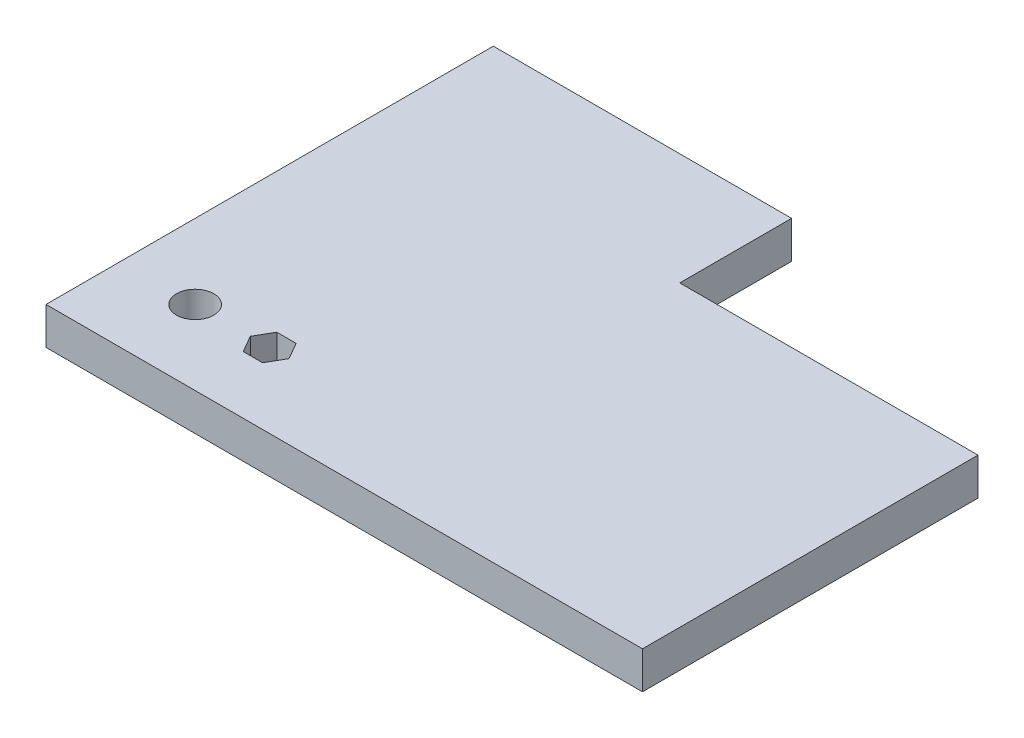
ISO-10303-21;
HEADER;
FILE_DESCRIPTION(('STEP AP214'),'2;1');
FILE_NAME('part.step','',(''),(''),'','','');
FILE_SCHEMA(('AUTOMOTIVE_DESIGN { 1 0 10303 214 1 1 1 1 }'));
ENDSEC;
DATA;
#1=APPLICATION_CONTEXT('core data for automotive mechanical design processes');
#2=APPLICATION_PROTOCOL_DEFINITION('international standard','automotive_design',2000,#1);
#3=PRODUCT_CONTEXT('',#1,'mechanical');
#4=PRODUCT('Part','Part','',(#3));
#5=PRODUCT_RELATED_PRODUCT_CATEGORY('part','',(#4));
#6=PRODUCT_DEFINITION_FORMATION('','',#4);
#7=PRODUCT_DEFINITION_CONTEXT('part definition',#1,'design');
#8=PRODUCT_DEFINITION('design','',#6,#7);
#9=PRODUCT_DEFINITION_SHAPE('','',#8);
#10=(LENGTH_UNIT() NAMED_UNIT(*) SI_UNIT(.MILLI.,.METRE.));
#11=(NAMED_UNIT(*) PLANE_ANGLE_UNIT() SI_UNIT($,.RADIAN.));
#12=(NAMED_UNIT(*) SI_UNIT($,.STERADIAN.) SOLID_ANGLE_UNIT());
#13=UNCERTAINTY_MEASURE_WITH_UNIT(LENGTH_MEASURE(1.E-05),#10,'distance_accuracy_value','');
#14=(GEOMETRIC_REPRESENTATION_CONTEXT(3) GLOBAL_UNCERTAINTY_ASSIGNED_CONTEXT((#13)) GLOBAL_UNIT_ASSIGNED_CONTEXT((#10,
#11,#12)) REPRESENTATION_CONTEXT('',''));
#15=CARTESIAN_POINT('',(0.,0.,0.));
#16=DIRECTION('',(0.,0.,1.));
#17=DIRECTION('',(1.,0.,0.));
#18=AXIS2_PLACEMENT_3D('',#15,#16,#17);
#19=CARTESIAN_POINT('',(800.,50.,0.));
#20=DIRECTION('',(0.,0.,-1.));
#21=DIRECTION('',(-1.,0.,0.));
#22=AXIS2_PLACEMENT_3D('',#19,#20,#21);
#23=PLANE('',#22);
#24=DIRECTION('',(1.,0.,0.));
#25=VECTOR('',#24,1.);
#26=CARTESIAN_POINT('',(800.,0.,0.));
#27=LINE('',#26,#25);
#28=CARTESIAN_POINT('',(0.,0.,0.));
#29=VERTEX_POINT('',#28);
#30=CARTESIAN_POINT('',(800.,0.,0.));
#31=VERTEX_POINT('',#30);
#32=EDGE_CURVE('E176',#29,#31,#27,.T.);
#33=ORIENTED_EDGE('',*,*,#32,.T.);
#34=DIRECTION('',(0.,-1.,0.));
#35=VECTOR('',#34,1.);
#36=CARTESIAN_POINT('',(800.,50.,0.));
#37=LINE('',#36,#35);
#38=CARTESIAN_POINT('',(800.,50.,0.));
#39=VERTEX_POINT('',#38);
#40=EDGE_CURVE('E11',#39,#31,#37,.T.);
#41=ORIENTED_EDGE('',*,*,#40,.F.);
#42=DIRECTION('',(1.,0.,0.));
#43=VECTOR('',#42,1.);
#44=CARTESIAN_POINT('',(800.,50.,0.));
#45=LINE('',#44,#43);
#46=CARTESIAN_POINT('',(0.,50.,0.));
#47=VERTEX_POINT('',#46);
#48=EDGE_CURVE('E179',#47,#39,#45,.T.);
#49=ORIENTED_EDGE('',*,*,#48,.F.);
#50=DIRECTION('',(0.,-1.,0.));
#51=VECTOR('',#50,1.);
#52=CARTESIAN_POINT('',(0.,50.,0.));
#53=LINE('',#52,#51);
#54=EDGE_CURVE('E193',#47,#29,#53,.T.);
#55=ORIENTED_EDGE('',*,*,#54,.T.);
#56=EDGE_LOOP('',(#33,#41,#49,#55));
#57=FACE_BOUND('',#56,.T.);
#58=ADVANCED_FACE('F32',(#57),#23,.F.);
#59=CARTESIAN_POINT('',(800.,50.,-450.));
#60=DIRECTION('',(-1.,0.,0.));
#61=DIRECTION('',(0.,0.,1.));
#62=AXIS2_PLACEMENT_3D('',#59,#60,#61);
#63=PLANE('',#62);
#64=DIRECTION('',(0.,0.,-1.));
#65=VECTOR('',#64,1.);
#66=CARTESIAN_POINT('',(800.,0.,-450.));
#67=LINE('',#66,#65);
#68=CARTESIAN_POINT('',(800.,0.,-450.));
#69=VERTEX_POINT('',#68);
#70=EDGE_CURVE('E196',#31,#69,#67,.T.);
#71=ORIENTED_EDGE('',*,*,#70,.T.);
#72=DIRECTION('',(0.,-1.,0.));
#73=VECTOR('',#72,1.);
#74=CARTESIAN_POINT('',(800.,50.,-450.));
#75=LINE('',#74,#73);
#76=CARTESIAN_POINT('',(800.,50.,-450.));
#77=VERTEX_POINT('',#76);
#78=EDGE_CURVE('E39',#77,#69,#75,.T.);
#79=ORIENTED_EDGE('',*,*,#78,.F.);
#80=DIRECTION('',(0.,0.,-1.));
#81=VECTOR('',#80,1.);
#82=CARTESIAN_POINT('',(800.,50.,-450.));
#83=LINE('',#82,#81);
#84=EDGE_CURVE('E182',#39,#77,#83,.T.);
#85=ORIENTED_EDGE('',*,*,#84,.F.);
#86=ORIENTED_EDGE('',*,*,#40,.T.);
#87=EDGE_LOOP('',(#71,#79,#85,#86));
#88=FACE_BOUND('',#87,.T.);
#89=ADVANCED_FACE('F242',(#88),#63,.F.);
#90=CARTESIAN_POINT('',(400.,50.,-450.));
#91=DIRECTION('',(0.,0.,1.));
#92=DIRECTION('',(1.,0.,0.));
#93=AXIS2_PLACEMENT_3D('',#90,#91,#92);
#94=PLANE('',#93);
#95=DIRECTION('',(-1.,0.,0.));
#96=VECTOR('',#95,1.);
#97=CARTESIAN_POINT('',(400.,0.,-450.));
#98=LINE('',#97,#96);
#99=CARTESIAN_POINT('',(400.,0.,-450.));
#100=VERTEX_POINT('',#99);
#101=EDGE_CURVE('E198',#69,#100,#98,.T.);
#102=ORIENTED_EDGE('',*,*,#101,.T.);
#103=DIRECTION('',(0.,-1.,0.));
#104=VECTOR('',#103,1.);
#105=CARTESIAN_POINT('',(400.,50.,-450.));
#106=LINE('',#105,#104);
#107=CARTESIAN_POINT('',(400.,50.,-450.));
#108=VERTEX_POINT('',#107);
#109=EDGE_CURVE('E213',#108,#100,#106,.T.);
#110=ORIENTED_EDGE('',*,*,#109,.F.);
#111=DIRECTION('',(-1.,0.,0.));
#112=VECTOR('',#111,1.);
#113=CARTESIAN_POINT('',(400.,50.,-450.));
#114=LINE('',#113,#112);
#115=EDGE_CURVE('E185',#77,#108,#114,.T.);
#116=ORIENTED_EDGE('',*,*,#115,.F.);
#117=ORIENTED_EDGE('',*,*,#78,.T.);
#118=EDGE_LOOP('',(#102,#110,#116,#117));
#119=FACE_BOUND('',#118,.T.);
#120=ADVANCED_FACE('F220',(#119),#94,.F.);
#121=CARTESIAN_POINT('',(400.,50.,-600.));
#122=DIRECTION('',(-1.,0.,0.));
#123=DIRECTION('',(0.,0.,1.));
#124=AXIS2_PLACEMENT_3D('',#121,#122,#123);
#125=PLANE('',#124);
#126=DIRECTION('',(0.,0.,-1.));
#127=VECTOR('',#126,1.);
#128=CARTESIAN_POINT('',(400.,0.,-600.));
#129=LINE('',#128,#127);
#130=CARTESIAN_POINT('',(400.,0.,-600.));
#131=VERTEX_POINT('',#130);
#132=EDGE_CURVE('E200',#100,#131,#129,.T.);
#133=ORIENTED_EDGE('',*,*,#132,.T.);
#134=DIRECTION('',(0.,-1.,0.));
#135=VECTOR('',#134,1.);
#136=CARTESIAN_POINT('',(400.,50.,-600.));
#137=LINE('',#136,#135);
#138=CARTESIAN_POINT('',(400.,50.,-600.));
#139=VERTEX_POINT('',#138);
#140=EDGE_CURVE('E210',#139,#131,#137,.T.);
#141=ORIENTED_EDGE('',*,*,#140,.F.);
#142=DIRECTION('',(0.,0.,-1.));
#143=VECTOR('',#142,1.);
#144=CARTESIAN_POINT('',(400.,50.,-600.));
#145=LINE('',#144,#143);
#146=EDGE_CURVE('E187',#108,#139,#145,.T.);
#147=ORIENTED_EDGE('',*,*,#146,.F.);
#148=ORIENTED_EDGE('',*,*,#109,.T.);
#149=EDGE_LOOP('',(#133,#141,#147,#148));
#150=FACE_BOUND('',#149,.T.);
#151=ADVANCED_FACE('F230',(#150),#125,.F.);
#152=CARTESIAN_POINT('',(0.,50.,-600.));
#153=DIRECTION('',(0.,0.,1.));
#154=DIRECTION('',(1.,0.,0.));
#155=AXIS2_PLACEMENT_3D('',#152,#153,#154);
#156=PLANE('',#155);
#157=DIRECTION('',(-1.,0.,0.));
#158=VECTOR('',#157,1.);
#159=CARTESIAN_POINT('',(0.,0.,-600.));
#160=LINE('',#159,#158);
#161=CARTESIAN_POINT('',(0.,0.,-600.));
#162=VERTEX_POINT('',#161);
#163=EDGE_CURVE('E202',#131,#162,#160,.T.);
#164=ORIENTED_EDGE('',*,*,#163,.T.);
#165=DIRECTION('',(0.,-1.,0.));
#166=VECTOR('',#165,1.);
#167=CARTESIAN_POINT('',(0.,50.,-600.));
#168=LINE('',#167,#166);
#169=CARTESIAN_POINT('',(0.,50.,-600.));
#170=VERTEX_POINT('',#169);
#171=EDGE_CURVE('E207',#170,#162,#168,.T.);
#172=ORIENTED_EDGE('',*,*,#171,.F.);
#173=DIRECTION('',(-1.,0.,0.));
#174=VECTOR('',#173,1.);
#175=CARTESIAN_POINT('',(0.,50.,-600.));
#176=LINE('',#175,#174);
#177=EDGE_CURVE('E189',#139,#170,#176,.T.);
#178=ORIENTED_EDGE('',*,*,#177,.F.);
#179=ORIENTED_EDGE('',*,*,#140,.T.);
#180=EDGE_LOOP('',(#164,#172,#178,#179));
#181=FACE_BOUND('',#180,.T.);
#182=ADVANCED_FACE('F234',(#181),#156,.F.);
#183=CARTESIAN_POINT('',(0.,50.,0.));
#184=DIRECTION('',(1.,0.,0.));
#185=DIRECTION('',(0.,0.,-1.));
#186=AXIS2_PLACEMENT_3D('',#183,#184,#185);
#187=PLANE('',#186);
#188=DIRECTION('',(0.,0.,1.));
#189=VECTOR('',#188,1.);
#190=CARTESIAN_POINT('',(0.,0.,0.));
#191=LINE('',#190,#189);
#192=EDGE_CURVE('E183',#162,#29,#191,.T.);
#193=ORIENTED_EDGE('',*,*,#192,.T.);
#194=ORIENTED_EDGE('',*,*,#54,.F.);
#195=DIRECTION('',(0.,0.,1.));
#196=VECTOR('',#195,1.);
#197=CARTESIAN_POINT('',(0.,50.,0.));
#198=LINE('',#197,#196);
#199=EDGE_CURVE('E191',#170,#47,#198,.T.);
#200=ORIENTED_EDGE('',*,*,#199,.F.);
#201=ORIENTED_EDGE('',*,*,#171,.T.);
#202=EDGE_LOOP('',(#193,#194,#200,#201));
#203=FACE_BOUND('',#202,.T.);
#204=ADVANCED_FACE('F245',(#203),#187,.F.);
#205=CARTESIAN_POINT('',(0.,50.,0.));
#206=DIRECTION('',(0.,-1.,0.));
#207=DIRECTION('',(0.,0.,-1.));
#208=AXIS2_PLACEMENT_3D('',#205,#206,#207);
#209=PLANE('',#208);
#210=DIRECTION('',(-0.5,0.,-0.866025403784439));
#211=VECTOR('',#210,1.);
#212=CARTESIAN_POINT('',(225.980762113533,50.,-100.));
#213=LINE('',#212,#211);
#214=CARTESIAN_POINT('',(225.980762113533,50.,-100.));
#215=VERTEX_POINT('',#214);
#216=CARTESIAN_POINT('',(212.990381056767,50.,-122.5));
#217=VERTEX_POINT('',#216);
#218=EDGE_CURVE('E153',#215,#217,#213,.T.);
#219=ORIENTED_EDGE('',*,*,#218,.F.);
#220=DIRECTION('',(0.5,0.,-0.866025403784439));
#221=VECTOR('',#220,1.);
#222=CARTESIAN_POINT('',(212.990381056767,50.,-77.5));
#223=LINE('',#222,#221);
#224=CARTESIAN_POINT('',(212.990381056767,50.,-77.5));
#225=VERTEX_POINT('',#224);
#226=EDGE_CURVE('E46',#225,#215,#223,.T.);
#227=ORIENTED_EDGE('',*,*,#226,.F.);
#228=DIRECTION('',(1.,0.,0.));
#229=VECTOR('',#228,1.);
#230=CARTESIAN_POINT('',(187.009618943233,50.,-77.5));
#231=LINE('',#230,#229);
#232=CARTESIAN_POINT('',(187.009618943233,50.,-77.5));
#233=VERTEX_POINT('',#232);
#234=EDGE_CURVE('E139',#233,#225,#231,.T.);
#235=ORIENTED_EDGE('',*,*,#234,.F.);
#236=DIRECTION('',(0.5,0.,0.866025403784438));
#237=VECTOR('',#236,1.);
#238=CARTESIAN_POINT('',(174.019237886467,50.,-100.));
#239=LINE('',#238,#237);
#240=CARTESIAN_POINT('',(174.019237886467,50.,-100.));
#241=VERTEX_POINT('',#240);
#242=EDGE_CURVE('E142',#241,#233,#239,.T.);
#243=ORIENTED_EDGE('',*,*,#242,.F.);
#244=DIRECTION('',(-0.499999999999999,0.,0.866025403784439));
#245=VECTOR('',#244,1.);
#246=CARTESIAN_POINT('',(187.009618943233,50.,-122.5));
#247=LINE('',#246,#245);
#248=CARTESIAN_POINT('',(187.009618943233,50.,-122.5));
#249=VERTEX_POINT('',#248);
#250=EDGE_CURVE('E158',#249,#241,#247,.T.);
#251=ORIENTED_EDGE('',*,*,#250,.F.);
#252=DIRECTION('',(-1.,0.,0.));
#253=VECTOR('',#252,1.);
#254=CARTESIAN_POINT('',(212.990381056767,50.,-122.5));
#255=LINE('',#254,#253);
#256=EDGE_CURVE('E155',#217,#249,#255,.T.);
#257=ORIENTED_EDGE('',*,*,#256,.F.);
#258=EDGE_LOOP('',(#219,#227,#235,#243,#251,#257));
#259=FACE_BOUND('',#258,.T.);
#260=CARTESIAN_POINT('',(100.,50.,-100.));
#261=DIRECTION('',(0.,1.,0.));
#262=DIRECTION('',(0.,0.,1.));
#263=AXIS2_PLACEMENT_3D('',#260,#261,#262);
#264=CIRCLE('',#263,25.);
#265=CARTESIAN_POINT('',(100.,50.,-75.));
#266=VERTEX_POINT('',#265);
#267=EDGE_CURVE('E165',#266,#266,#264,.T.);
#268=ORIENTED_EDGE('',*,*,#267,.F.);
#269=EDGE_LOOP('',(#268));
#270=FACE_BOUND('',#269,.T.);
#271=ORIENTED_EDGE('',*,*,#48,.T.);
#272=ORIENTED_EDGE('',*,*,#84,.T.);
#273=ORIENTED_EDGE('',*,*,#115,.T.);
#274=ORIENTED_EDGE('',*,*,#146,.T.);
#275=ORIENTED_EDGE('',*,*,#177,.T.);
#276=ORIENTED_EDGE('',*,*,#199,.T.);
#277=EDGE_LOOP('',(#271,#272,#273,#274,#275,#276));
#278=FACE_BOUND('',#277,.T.);
#279=ADVANCED_FACE('F238',(#259,#270,#278),#209,.F.);
#280=CARTESIAN_POINT('',(0.,0.,0.));
#281=DIRECTION('',(0.,-1.,0.));
#282=DIRECTION('',(0.,0.,-1.));
#283=AXIS2_PLACEMENT_3D('',#280,#281,#282);
#284=PLANE('',#283);
#285=DIRECTION('',(0.5,0.,-0.866025403784439));
#286=VECTOR('',#285,1.);
#287=CARTESIAN_POINT('',(212.990381056767,0.,-77.5));
#288=LINE('',#287,#286);
#289=CARTESIAN_POINT('',(212.990381056767,0.,-77.5));
#290=VERTEX_POINT('',#289);
#291=CARTESIAN_POINT('',(225.980762113533,0.,-100.));
#292=VERTEX_POINT('',#291);
#293=EDGE_CURVE('E122',#290,#292,#288,.T.);
#294=ORIENTED_EDGE('',*,*,#293,.T.);
#295=DIRECTION('',(-0.5,0.,-0.866025403784439));
#296=VECTOR('',#295,1.);
#297=CARTESIAN_POINT('',(225.980762113533,0.,-100.));
#298=LINE('',#297,#296);
#299=CARTESIAN_POINT('',(212.990381056767,0.,-122.5));
#300=VERTEX_POINT('',#299);
#301=EDGE_CURVE('E131',#292,#300,#298,.T.);
#302=ORIENTED_EDGE('',*,*,#301,.T.);
#303=DIRECTION('',(-1.,0.,0.));
#304=VECTOR('',#303,1.);
#305=CARTESIAN_POINT('',(212.990381056767,0.,-122.5));
#306=LINE('',#305,#304);
#307=CARTESIAN_POINT('',(187.009618943233,0.,-122.5));
#308=VERTEX_POINT('',#307);
#309=EDGE_CURVE('E54',#300,#308,#306,.T.);
#310=ORIENTED_EDGE('',*,*,#309,.T.);
#311=DIRECTION('',(-0.499999999999999,0.,0.866025403784439));
#312=VECTOR('',#311,1.);
#313=CARTESIAN_POINT('',(187.009618943233,0.,-122.5));
#314=LINE('',#313,#312);
#315=CARTESIAN_POINT('',(174.019237886467,0.,-100.));
#316=VERTEX_POINT('',#315);
#317=EDGE_CURVE('E146',#308,#316,#314,.T.);
#318=ORIENTED_EDGE('',*,*,#317,.T.);
#319=DIRECTION('',(0.5,0.,0.866025403784438));
#320=VECTOR('',#319,1.);
#321=CARTESIAN_POINT('',(174.019237886467,0.,-100.));
#322=LINE('',#321,#320);
#323=CARTESIAN_POINT('',(187.009618943233,0.,-77.5));
#324=VERTEX_POINT('',#323);
#325=EDGE_CURVE('E149',#316,#324,#322,.T.);
#326=ORIENTED_EDGE('',*,*,#325,.T.);
#327=DIRECTION('',(1.,0.,0.));
#328=VECTOR('',#327,1.);
#329=CARTESIAN_POINT('',(187.009618943233,0.,-77.5));
#330=LINE('',#329,#328);
#331=EDGE_CURVE('E128',#324,#290,#330,.T.);
#332=ORIENTED_EDGE('',*,*,#331,.T.);
#333=EDGE_LOOP('',(#294,#302,#310,#318,#326,#332));
#334=FACE_BOUND('',#333,.T.);
#335=CARTESIAN_POINT('',(100.,0.,-100.));
#336=DIRECTION('',(0.,1.,0.));
#337=DIRECTION('',(0.,0.,1.));
#338=AXIS2_PLACEMENT_3D('',#335,#336,#337);
#339=CIRCLE('',#338,25.);
#340=CARTESIAN_POINT('',(100.,0.,-75.));
#341=VERTEX_POINT('',#340);
#342=EDGE_CURVE('E173',#341,#341,#339,.T.);
#343=ORIENTED_EDGE('',*,*,#342,.T.);
#344=EDGE_LOOP('',(#343));
#345=FACE_BOUND('',#344,.T.);
#346=ORIENTED_EDGE('',*,*,#32,.F.);
#347=ORIENTED_EDGE('',*,*,#192,.F.);
#348=ORIENTED_EDGE('',*,*,#163,.F.);
#349=ORIENTED_EDGE('',*,*,#132,.F.);
#350=ORIENTED_EDGE('',*,*,#101,.F.);
#351=ORIENTED_EDGE('',*,*,#70,.F.);
#352=EDGE_LOOP('',(#346,#347,#348,#349,#350,#351));
#353=FACE_BOUND('',#352,.T.);
#354=ADVANCED_FACE('F135',(#334,#345,#353),#284,.T.);
#355=CARTESIAN_POINT('',(100.,0.,-100.));
#356=DIRECTION('',(0.,1.,0.));
#357=DIRECTION('',(0.,0.,1.));
#358=AXIS2_PLACEMENT_3D('',#355,#356,#357);
#359=CYLINDRICAL_SURFACE('',#358,25.);
#360=ORIENTED_EDGE('',*,*,#342,.F.);
#361=EDGE_LOOP('',(#360));
#362=FACE_BOUND('',#361,.T.);
#363=ORIENTED_EDGE('',*,*,#267,.T.);
#364=EDGE_LOOP('',(#363));
#365=FACE_BOUND('',#364,.T.);
#366=ADVANCED_FACE('F284',(#362,#365),#359,.F.);
#367=CARTESIAN_POINT('',(212.990381056767,0.,-77.5));
#368=DIRECTION('',(0.866025403784439,0.,0.5));
#369=DIRECTION('',(0.5,0.,-0.866025403784439));
#370=AXIS2_PLACEMENT_3D('',#367,#368,#369);
#371=PLANE('',#370);
#372=ORIENTED_EDGE('',*,*,#226,.T.);
#373=DIRECTION('',(0.,1.,0.));
#374=VECTOR('',#373,1.);
#375=CARTESIAN_POINT('',(225.980762113533,0.,-100.));
#376=LINE('',#375,#374);
#377=EDGE_CURVE('E118',#292,#215,#376,.T.);
#378=ORIENTED_EDGE('',*,*,#377,.F.);
#379=ORIENTED_EDGE('',*,*,#293,.F.);
#380=DIRECTION('',(0.,1.,0.));
#381=VECTOR('',#380,1.);
#382=CARTESIAN_POINT('',(212.990381056767,0.,-77.5));
#383=LINE('',#382,#381);
#384=EDGE_CURVE('E163',#290,#225,#383,.T.);
#385=ORIENTED_EDGE('',*,*,#384,.T.);
#386=EDGE_LOOP('',(#372,#378,#379,#385));
#387=FACE_BOUND('',#386,.T.);
#388=ADVANCED_FACE('F120',(#387),#371,.F.);
#389=CARTESIAN_POINT('',(187.009618943233,0.,-77.5));
#390=DIRECTION('',(0.,0.,1.));
#391=DIRECTION('',(1.,0.,0.));
#392=AXIS2_PLACEMENT_3D('',#389,#390,#391);
#393=PLANE('',#392);
#394=ORIENTED_EDGE('',*,*,#234,.T.);
#395=ORIENTED_EDGE('',*,*,#384,.F.);
#396=ORIENTED_EDGE('',*,*,#331,.F.);
#397=DIRECTION('',(0.,1.,0.));
#398=VECTOR('',#397,1.);
#399=CARTESIAN_POINT('',(187.009618943233,0.,-77.5));
#400=LINE('',#399,#398);
#401=EDGE_CURVE('E166',#324,#233,#400,.T.);
#402=ORIENTED_EDGE('',*,*,#401,.T.);
#403=EDGE_LOOP('',(#394,#395,#396,#402));
#404=FACE_BOUND('',#403,.T.);
#405=ADVANCED_FACE('F310',(#404),#393,.F.);
#406=CARTESIAN_POINT('',(174.019237886467,0.,-100.));
#407=DIRECTION('',(-0.866025403784438,0.,0.5));
#408=DIRECTION('',(0.5,0.,0.866025403784439));
#409=AXIS2_PLACEMENT_3D('',#406,#407,#408);
#410=PLANE('',#409);
#411=ORIENTED_EDGE('',*,*,#242,.T.);
#412=ORIENTED_EDGE('',*,*,#401,.F.);
#413=ORIENTED_EDGE('',*,*,#325,.F.);
#414=DIRECTION('',(0.,1.,0.));
#415=VECTOR('',#414,1.);
#416=CARTESIAN_POINT('',(174.019237886467,0.,-100.));
#417=LINE('',#416,#415);
#418=EDGE_CURVE('E168',#316,#241,#417,.T.);
#419=ORIENTED_EDGE('',*,*,#418,.T.);
#420=EDGE_LOOP('',(#411,#412,#413,#419));
#421=FACE_BOUND('',#420,.T.);
#422=ADVANCED_FACE('F319',(#421),#410,.F.);
#423=CARTESIAN_POINT('',(187.009618943233,0.,-122.5));
#424=DIRECTION('',(-0.866025403784439,0.,-0.499999999999999));
#425=DIRECTION('',(-0.499999999999999,0.,0.866025403784439));
#426=AXIS2_PLACEMENT_3D('',#423,#424,#425);
#427=PLANE('',#426);
#428=ORIENTED_EDGE('',*,*,#250,.T.);
#429=ORIENTED_EDGE('',*,*,#418,.F.);
#430=ORIENTED_EDGE('',*,*,#317,.F.);
#431=DIRECTION('',(0.,1.,0.));
#432=VECTOR('',#431,1.);
#433=CARTESIAN_POINT('',(187.009618943233,0.,-122.5));
#434=LINE('',#433,#432);
#435=EDGE_CURVE('E170',#308,#249,#434,.T.);
#436=ORIENTED_EDGE('',*,*,#435,.T.);
#437=EDGE_LOOP('',(#428,#429,#430,#436));
#438=FACE_BOUND('',#437,.T.);
#439=ADVANCED_FACE('F329',(#438),#427,.F.);
#440=CARTESIAN_POINT('',(212.990381056767,0.,-122.5));
#441=DIRECTION('',(0.,0.,-1.));
#442=DIRECTION('',(-1.,0.,0.));
#443=AXIS2_PLACEMENT_3D('',#440,#441,#442);
#444=PLANE('',#443);
#445=ORIENTED_EDGE('',*,*,#256,.T.);
#446=ORIENTED_EDGE('',*,*,#435,.F.);
#447=ORIENTED_EDGE('',*,*,#309,.F.);
#448=DIRECTION('',(0.,1.,0.));
#449=VECTOR('',#448,1.);
#450=CARTESIAN_POINT('',(212.990381056767,0.,-122.5));
#451=LINE('',#450,#449);
#452=EDGE_CURVE('E127',#300,#217,#451,.T.);
#453=ORIENTED_EDGE('',*,*,#452,.T.);
#454=EDGE_LOOP('',(#445,#446,#447,#453));
#455=FACE_BOUND('',#454,.T.);
#456=ADVANCED_FACE('F339',(#455),#444,.F.);
#457=CARTESIAN_POINT('',(225.980762113533,0.,-100.));
#458=DIRECTION('',(0.866025403784439,0.,-0.5));
#459=DIRECTION('',(-0.5,0.,-0.866025403784439));
#460=AXIS2_PLACEMENT_3D('',#457,#458,#459);
#461=PLANE('',#460);
#462=ORIENTED_EDGE('',*,*,#218,.T.);
#463=ORIENTED_EDGE('',*,*,#452,.F.);
#464=ORIENTED_EDGE('',*,*,#301,.F.);
#465=ORIENTED_EDGE('',*,*,#377,.T.);
#466=EDGE_LOOP('',(#462,#463,#464,#465));
#467=FACE_BOUND('',#466,.T.);
#468=ADVANCED_FACE('F132',(#467),#461,.F.);
#469=CLOSED_SHELL('',(#58,#89,#120,#151,#182,#204,#279,#354,#366,#388,#405,#422,#439,#456,#468));
#470=MANIFOLD_SOLID_BREP('B2',#469);
#471=ADVANCED_BREP_SHAPE_REPRESENTATION('',(#18,#470),#14);
#472=SHAPE_DEFINITION_REPRESENTATION(#9,#471);
ENDSEC;
END-ISO-10303-21;
